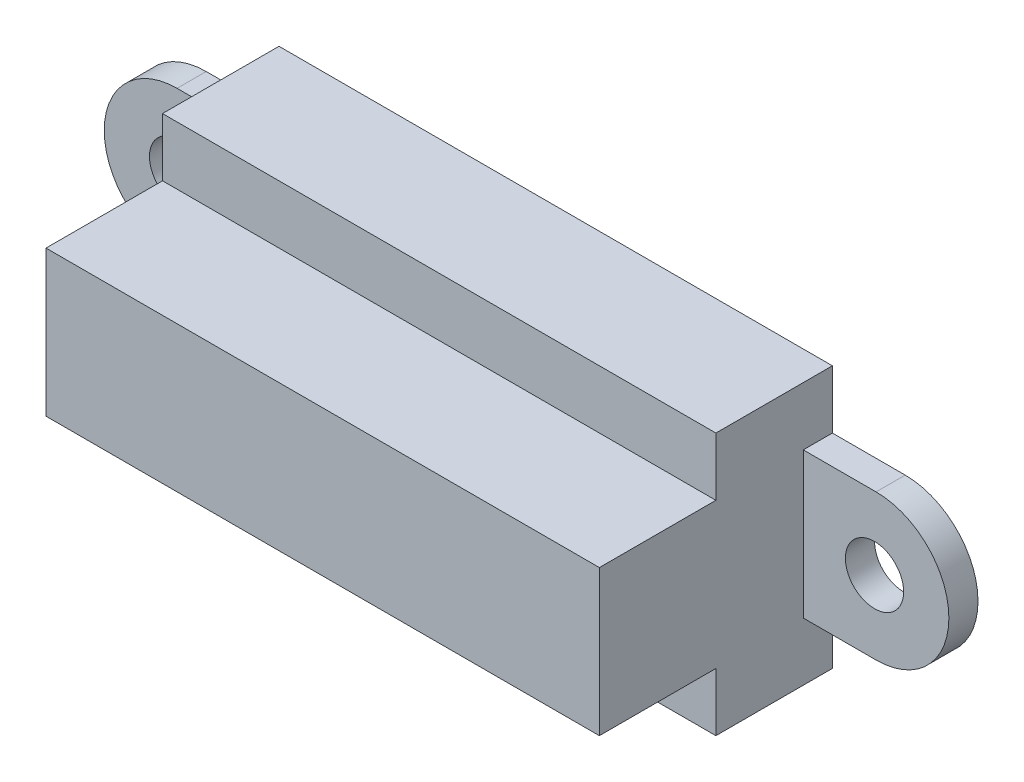
ISO-10303-21;
HEADER;
FILE_DESCRIPTION(('STEP AP214'),'2;1');
FILE_NAME('part.step','',(''),(''),'','','');
FILE_SCHEMA(('AUTOMOTIVE_DESIGN { 1 0 10303 214 1 1 1 1 }'));
ENDSEC;
DATA;
#1=APPLICATION_CONTEXT('core data for automotive mechanical design processes');
#2=APPLICATION_PROTOCOL_DEFINITION('international standard','automotive_design',2000,#1);
#3=PRODUCT_CONTEXT('',#1,'mechanical');
#4=PRODUCT('Part','Part','',(#3));
#5=PRODUCT_RELATED_PRODUCT_CATEGORY('part','',(#4));
#6=PRODUCT_DEFINITION_FORMATION('','',#4);
#7=PRODUCT_DEFINITION_CONTEXT('part definition',#1,'design');
#8=PRODUCT_DEFINITION('design','',#6,#7);
#9=PRODUCT_DEFINITION_SHAPE('','',#8);
#10=(LENGTH_UNIT() NAMED_UNIT(*) SI_UNIT(.MILLI.,.METRE.));
#11=(NAMED_UNIT(*) PLANE_ANGLE_UNIT() SI_UNIT($,.RADIAN.));
#12=(NAMED_UNIT(*) SI_UNIT($,.STERADIAN.) SOLID_ANGLE_UNIT());
#13=UNCERTAINTY_MEASURE_WITH_UNIT(LENGTH_MEASURE(1.E-05),#10,'distance_accuracy_value','');
#14=(GEOMETRIC_REPRESENTATION_CONTEXT(3) GLOBAL_UNCERTAINTY_ASSIGNED_CONTEXT((#13)) GLOBAL_UNIT_ASSIGNED_CONTEXT((#10,
#11,#12)) REPRESENTATION_CONTEXT('',''));
#15=CARTESIAN_POINT('',(0.,0.,0.));
#16=DIRECTION('',(0.,0.,1.));
#17=DIRECTION('',(1.,0.,0.));
#18=AXIS2_PLACEMENT_3D('',#15,#16,#17);
#19=CARTESIAN_POINT('',(15.08125,7.14375,0.));
#20=DIRECTION('',(0.,0.,-1.));
#21=DIRECTION('',(-1.,0.,0.));
#22=AXIS2_PLACEMENT_3D('',#19,#20,#21);
#23=PLANE('',#22);
#24=DIRECTION('',(0.,1.,0.));
#25=VECTOR('',#24,1.);
#26=CARTESIAN_POINT('',(15.08125,-7.14375,0.));
#27=LINE('',#26,#25);
#28=CARTESIAN_POINT('',(15.08125,-7.14375,0.));
#29=VERTEX_POINT('',#28);
#30=CARTESIAN_POINT('',(15.08125,-3.96875,0.));
#31=VERTEX_POINT('',#30);
#32=EDGE_CURVE('E347',#29,#31,#27,.T.);
#33=ORIENTED_EDGE('',*,*,#32,.F.);
#34=DIRECTION('',(1.,0.,0.));
#35=VECTOR('',#34,1.);
#36=CARTESIAN_POINT('',(-15.08125,-7.14375,0.));
#37=LINE('',#36,#35);
#38=CARTESIAN_POINT('',(-15.08125,-7.14375,0.));
#39=VERTEX_POINT('',#38);
#40=EDGE_CURVE('E210',#39,#29,#37,.T.);
#41=ORIENTED_EDGE('',*,*,#40,.F.);
#42=DIRECTION('',(0.,-1.,0.));
#43=VECTOR('',#42,1.);
#44=CARTESIAN_POINT('',(-15.08125,-7.14375,0.));
#45=LINE('',#44,#43);
#46=CARTESIAN_POINT('',(-15.08125,-3.96875,0.));
#47=VERTEX_POINT('',#46);
#48=EDGE_CURVE('E200',#47,#39,#45,.T.);
#49=ORIENTED_EDGE('',*,*,#48,.F.);
#50=DIRECTION('',(-1.,0.,0.));
#51=VECTOR('',#50,1.);
#52=CARTESIAN_POINT('',(27.8226999033216,-3.96875000000001,0.));
#53=LINE('',#52,#51);
#54=CARTESIAN_POINT('',(-19.05,-3.96875,0.));
#55=VERTEX_POINT('',#54);
#56=EDGE_CURVE('E50',#47,#55,#53,.T.);
#57=ORIENTED_EDGE('',*,*,#56,.T.);
#58=CARTESIAN_POINT('',(-19.05,0.,0.));
#59=DIRECTION('',(0.,0.,1.));
#60=DIRECTION('',(1.,0.,0.));
#61=AXIS2_PLACEMENT_3D('',#58,#59,#60);
#62=CIRCLE('',#61,3.96875);
#63=CARTESIAN_POINT('',(-19.05,3.96875,0.));
#64=VERTEX_POINT('',#63);
#65=EDGE_CURVE('E180',#64,#55,#62,.T.);
#66=ORIENTED_EDGE('',*,*,#65,.F.);
#67=DIRECTION('',(1.,0.,0.));
#68=VECTOR('',#67,1.);
#69=CARTESIAN_POINT('',(27.8226999033216,3.96874999999989,0.));
#70=LINE('',#69,#68);
#71=CARTESIAN_POINT('',(-15.08125,3.96875,0.));
#72=VERTEX_POINT('',#71);
#73=EDGE_CURVE('E156',#64,#72,#70,.T.);
#74=ORIENTED_EDGE('',*,*,#73,.T.);
#75=CARTESIAN_POINT('',(-15.08125,7.14375,0.));
#76=VERTEX_POINT('',#75);
#77=EDGE_CURVE('E203',#76,#72,#45,.T.);
#78=ORIENTED_EDGE('',*,*,#77,.F.);
#79=DIRECTION('',(-1.,0.,0.));
#80=VECTOR('',#79,1.);
#81=CARTESIAN_POINT('',(-15.08125,7.14375,0.));
#82=LINE('',#81,#80);
#83=CARTESIAN_POINT('',(15.08125,7.14375,0.));
#84=VERTEX_POINT('',#83);
#85=EDGE_CURVE('E204',#84,#76,#82,.T.);
#86=ORIENTED_EDGE('',*,*,#85,.F.);
#87=CARTESIAN_POINT('',(15.08125,3.96874999999999,0.));
#88=VERTEX_POINT('',#87);
#89=EDGE_CURVE('E300',#88,#84,#27,.T.);
#90=ORIENTED_EDGE('',*,*,#89,.F.);
#91=DIRECTION('',(-1.,0.,0.));
#92=VECTOR('',#91,1.);
#93=CARTESIAN_POINT('',(-27.8226999033216,3.96874999999989,0.));
#94=LINE('',#93,#92);
#95=CARTESIAN_POINT('',(19.05,3.96875,0.));
#96=VERTEX_POINT('',#95);
#97=EDGE_CURVE('E58',#96,#88,#94,.T.);
#98=ORIENTED_EDGE('',*,*,#97,.F.);
#99=CARTESIAN_POINT('',(19.05,0.,0.));
#100=DIRECTION('',(0.,0.,-1.));
#101=DIRECTION('',(-1.,0.,0.));
#102=AXIS2_PLACEMENT_3D('',#99,#100,#101);
#103=CIRCLE('',#102,3.96875);
#104=CARTESIAN_POINT('',(19.05,-3.96875,0.));
#105=VERTEX_POINT('',#104);
#106=EDGE_CURVE('E311',#96,#105,#103,.T.);
#107=ORIENTED_EDGE('',*,*,#106,.T.);
#108=DIRECTION('',(1.,0.,0.));
#109=VECTOR('',#108,1.);
#110=CARTESIAN_POINT('',(-27.8226999033216,-3.96875000000001,0.));
#111=LINE('',#110,#109);
#112=EDGE_CURVE('E304',#31,#105,#111,.T.);
#113=ORIENTED_EDGE('',*,*,#112,.F.);
#114=EDGE_LOOP('',(#33,#41,#49,#57,#66,#74,#78,#86,#90,#98,#107,#113));
#115=FACE_BOUND('',#114,.T.);
#116=CARTESIAN_POINT('',(18.96610193771,0.,0.));
#117=DIRECTION('',(0.,0.,1.));
#118=DIRECTION('',(1.,0.,0.));
#119=AXIS2_PLACEMENT_3D('',#116,#117,#118);
#120=CIRCLE('',#119,1.5875);
#121=CARTESIAN_POINT('',(20.55360193771,0.,0.));
#122=VERTEX_POINT('',#121);
#123=EDGE_CURVE('E317',#122,#122,#120,.T.);
#124=ORIENTED_EDGE('',*,*,#123,.T.);
#125=EDGE_LOOP('',(#124));
#126=FACE_BOUND('',#125,.T.);
#127=CARTESIAN_POINT('',(-18.96610193771,0.,0.));
#128=DIRECTION('',(0.,0.,-1.));
#129=DIRECTION('',(-1.,0.,0.));
#130=AXIS2_PLACEMENT_3D('',#127,#128,#129);
#131=CIRCLE('',#130,1.5875);
#132=CARTESIAN_POINT('',(-20.55360193771,0.,0.));
#133=VERTEX_POINT('',#132);
#134=EDGE_CURVE('E182',#133,#133,#131,.T.);
#135=ORIENTED_EDGE('',*,*,#134,.F.);
#136=EDGE_LOOP('',(#135));
#137=FACE_BOUND('',#136,.T.);
#138=ADVANCED_FACE('F33',(#115,#126,#137),#23,.T.);
#139=CARTESIAN_POINT('',(27.8226999033216,0.,1.5875));
#140=DIRECTION('',(0.,0.,-1.));
#141=DIRECTION('',(1.,0.,0.));
#142=AXIS2_PLACEMENT_3D('',#139,#140,#141);
#143=PLANE('',#142);
#144=CARTESIAN_POINT('',(-19.05,0.,1.5875));
#145=DIRECTION('',(0.,0.,1.));
#146=DIRECTION('',(1.,0.,0.));
#147=AXIS2_PLACEMENT_3D('',#144,#145,#146);
#148=CIRCLE('',#147,3.96875);
#149=CARTESIAN_POINT('',(-19.05,3.96875,1.5875));
#150=VERTEX_POINT('',#149);
#151=CARTESIAN_POINT('',(-19.05,-3.96875,1.5875));
#152=VERTEX_POINT('',#151);
#153=EDGE_CURVE('E164',#150,#152,#148,.T.);
#154=ORIENTED_EDGE('',*,*,#153,.T.);
#155=DIRECTION('',(-1.,0.,0.));
#156=VECTOR('',#155,1.);
#157=CARTESIAN_POINT('',(27.8226999033216,-3.96875000000001,1.5875));
#158=LINE('',#157,#156);
#159=CARTESIAN_POINT('',(-15.08125,-3.96875,1.5875));
#160=VERTEX_POINT('',#159);
#161=EDGE_CURVE('E161',#160,#152,#158,.T.);
#162=ORIENTED_EDGE('',*,*,#161,.F.);
#163=DIRECTION('',(0.,-1.,0.));
#164=VECTOR('',#163,1.);
#165=CARTESIAN_POINT('',(-15.08125,0.,1.5875));
#166=LINE('',#165,#164);
#167=CARTESIAN_POINT('',(-15.08125,3.96875,1.5875));
#168=VERTEX_POINT('',#167);
#169=EDGE_CURVE('E174',#168,#160,#166,.T.);
#170=ORIENTED_EDGE('',*,*,#169,.F.);
#171=DIRECTION('',(1.,0.,0.));
#172=VECTOR('',#171,1.);
#173=CARTESIAN_POINT('',(27.8226999033216,3.96874999999989,1.5875));
#174=LINE('',#173,#172);
#175=EDGE_CURVE('E153',#150,#168,#174,.T.);
#176=ORIENTED_EDGE('',*,*,#175,.F.);
#177=EDGE_LOOP('',(#154,#162,#170,#176));
#178=FACE_BOUND('',#177,.T.);
#179=CARTESIAN_POINT('',(-18.96610193771,0.,1.5875));
#180=DIRECTION('',(0.,0.,-1.));
#181=DIRECTION('',(-1.,0.,0.));
#182=AXIS2_PLACEMENT_3D('',#179,#180,#181);
#183=CIRCLE('',#182,1.5875);
#184=CARTESIAN_POINT('',(-20.55360193771,0.,1.5875));
#185=VERTEX_POINT('',#184);
#186=EDGE_CURVE('E555',#185,#185,#183,.T.);
#187=ORIENTED_EDGE('',*,*,#186,.T.);
#188=EDGE_LOOP('',(#187));
#189=FACE_BOUND('',#188,.T.);
#190=ADVANCED_FACE('F171',(#178,#189),#143,.F.);
#191=CARTESIAN_POINT('',(-15.08125,-7.14375,6.35));
#192=DIRECTION('',(1.,0.,0.));
#193=DIRECTION('',(0.,0.,-1.));
#194=AXIS2_PLACEMENT_3D('',#191,#192,#193);
#195=PLANE('',#194);
#196=DIRECTION('',(0.,0.,-1.));
#197=VECTOR('',#196,1.);
#198=CARTESIAN_POINT('',(-15.08125,3.96875,1.5875));
#199=LINE('',#198,#197);
#200=EDGE_CURVE('E160',#168,#72,#199,.T.);
#201=ORIENTED_EDGE('',*,*,#200,.F.);
#202=ORIENTED_EDGE('',*,*,#169,.T.);
#203=DIRECTION('',(0.,0.,-1.));
#204=VECTOR('',#203,1.);
#205=CARTESIAN_POINT('',(-15.08125,-3.96875,1.5875));
#206=LINE('',#205,#204);
#207=EDGE_CURVE('E185',#160,#47,#206,.T.);
#208=ORIENTED_EDGE('',*,*,#207,.T.);
#209=ORIENTED_EDGE('',*,*,#48,.T.);
#210=DIRECTION('',(0.,0.,-1.));
#211=VECTOR('',#210,1.);
#212=CARTESIAN_POINT('',(-15.08125,-7.14375,6.35));
#213=LINE('',#212,#211);
#214=CARTESIAN_POINT('',(-15.08125,-7.14375,6.35));
#215=VERTEX_POINT('',#214);
#216=EDGE_CURVE('E217',#215,#39,#213,.T.);
#217=ORIENTED_EDGE('',*,*,#216,.F.);
#218=DIRECTION('',(0.,-1.,0.));
#219=VECTOR('',#218,1.);
#220=CARTESIAN_POINT('',(-15.08125,-7.14375,6.35));
#221=LINE('',#220,#219);
#222=CARTESIAN_POINT('',(-15.08125,-3.96875,6.35));
#223=VERTEX_POINT('',#222);
#224=EDGE_CURVE('E235',#223,#215,#221,.T.);
#225=ORIENTED_EDGE('',*,*,#224,.F.);
#226=DIRECTION('',(0.,0.,-1.));
#227=VECTOR('',#226,1.);
#228=CARTESIAN_POINT('',(-15.08125,-3.96875,12.7));
#229=LINE('',#228,#227);
#230=CARTESIAN_POINT('',(-15.08125,-3.96875,12.7));
#231=VERTEX_POINT('',#230);
#232=EDGE_CURVE('E271',#231,#223,#229,.T.);
#233=ORIENTED_EDGE('',*,*,#232,.F.);
#234=DIRECTION('',(0.,-1.,0.));
#235=VECTOR('',#234,1.);
#236=CARTESIAN_POINT('',(-15.08125,3.96875,12.7));
#237=LINE('',#236,#235);
#238=CARTESIAN_POINT('',(-15.08125,3.96875,12.7));
#239=VERTEX_POINT('',#238);
#240=EDGE_CURVE('E274',#239,#231,#237,.T.);
#241=ORIENTED_EDGE('',*,*,#240,.F.);
#242=DIRECTION('',(0.,0.,-1.));
#243=VECTOR('',#242,1.);
#244=CARTESIAN_POINT('',(-15.08125,3.96875,12.7));
#245=LINE('',#244,#243);
#246=CARTESIAN_POINT('',(-15.08125,3.96874999999999,6.35));
#247=VERTEX_POINT('',#246);
#248=EDGE_CURVE('E284',#239,#247,#245,.T.);
#249=ORIENTED_EDGE('',*,*,#248,.T.);
#250=CARTESIAN_POINT('',(-15.08125,7.14375,6.35));
#251=VERTEX_POINT('',#250);
#252=EDGE_CURVE('E241',#251,#247,#221,.T.);
#253=ORIENTED_EDGE('',*,*,#252,.F.);
#254=DIRECTION('',(0.,0.,-1.));
#255=VECTOR('',#254,1.);
#256=CARTESIAN_POINT('',(-15.08125,7.14375,6.35));
#257=LINE('',#256,#255);
#258=EDGE_CURVE('E42',#251,#76,#257,.T.);
#259=ORIENTED_EDGE('',*,*,#258,.T.);
#260=ORIENTED_EDGE('',*,*,#77,.T.);
#261=EDGE_LOOP('',(#201,#202,#208,#209,#217,#225,#233,#241,#249,#253,#259,#260));
#262=FACE_BOUND('',#261,.T.);
#263=ADVANCED_FACE('F256',(#262),#195,.F.);
#264=CARTESIAN_POINT('',(15.08125,-7.14375,6.35));
#265=DIRECTION('',(-1.,0.,0.));
#266=DIRECTION('',(0.,0.,1.));
#267=AXIS2_PLACEMENT_3D('',#264,#265,#266);
#268=PLANE('',#267);
#269=DIRECTION('',(0.,0.,-1.));
#270=VECTOR('',#269,1.);
#271=CARTESIAN_POINT('',(15.08125,-3.96875,1.5875));
#272=LINE('',#271,#270);
#273=CARTESIAN_POINT('',(15.08125,-3.96875,1.5875));
#274=VERTEX_POINT('',#273);
#275=EDGE_CURVE('E293',#274,#31,#272,.T.);
#276=ORIENTED_EDGE('',*,*,#275,.F.);
#277=DIRECTION('',(0.,-1.,0.));
#278=VECTOR('',#277,1.);
#279=CARTESIAN_POINT('',(15.08125,0.,1.5875));
#280=LINE('',#279,#278);
#281=CARTESIAN_POINT('',(15.08125,3.96875,1.5875));
#282=VERTEX_POINT('',#281);
#283=EDGE_CURVE('E322',#282,#274,#280,.T.);
#284=ORIENTED_EDGE('',*,*,#283,.F.);
#285=DIRECTION('',(0.,0.,-1.));
#286=VECTOR('',#285,1.);
#287=CARTESIAN_POINT('',(15.08125,3.96875,1.5875));
#288=LINE('',#287,#286);
#289=EDGE_CURVE('E276',#282,#88,#288,.T.);
#290=ORIENTED_EDGE('',*,*,#289,.T.);
#291=ORIENTED_EDGE('',*,*,#89,.T.);
#292=DIRECTION('',(0.,0.,-1.));
#293=VECTOR('',#292,1.);
#294=CARTESIAN_POINT('',(15.08125,7.14375,6.35));
#295=LINE('',#294,#293);
#296=CARTESIAN_POINT('',(15.08125,7.14375,6.35));
#297=VERTEX_POINT('',#296);
#298=EDGE_CURVE('E11',#297,#84,#295,.T.);
#299=ORIENTED_EDGE('',*,*,#298,.F.);
#300=DIRECTION('',(0.,1.,0.));
#301=VECTOR('',#300,1.);
#302=CARTESIAN_POINT('',(15.08125,-7.14375,6.35));
#303=LINE('',#302,#301);
#304=CARTESIAN_POINT('',(15.08125,3.96874999999999,6.35));
#305=VERTEX_POINT('',#304);
#306=EDGE_CURVE('E213',#305,#297,#303,.T.);
#307=ORIENTED_EDGE('',*,*,#306,.F.);
#308=DIRECTION('',(0.,0.,-1.));
#309=VECTOR('',#308,1.);
#310=CARTESIAN_POINT('',(15.08125,3.96875,12.7));
#311=LINE('',#310,#309);
#312=CARTESIAN_POINT('',(15.08125,3.96875,12.7));
#313=VERTEX_POINT('',#312);
#314=EDGE_CURVE('E353',#313,#305,#311,.T.);
#315=ORIENTED_EDGE('',*,*,#314,.F.);
#316=DIRECTION('',(0.,1.,0.));
#317=VECTOR('',#316,1.);
#318=CARTESIAN_POINT('',(15.08125,3.96875,12.7));
#319=LINE('',#318,#317);
#320=CARTESIAN_POINT('',(15.08125,-3.96875,12.7));
#321=VERTEX_POINT('',#320);
#322=EDGE_CURVE('E285',#321,#313,#319,.T.);
#323=ORIENTED_EDGE('',*,*,#322,.F.);
#324=DIRECTION('',(0.,0.,-1.));
#325=VECTOR('',#324,1.);
#326=CARTESIAN_POINT('',(15.08125,-3.96875,12.7));
#327=LINE('',#326,#325);
#328=CARTESIAN_POINT('',(15.08125,-3.96875,6.35));
#329=VERTEX_POINT('',#328);
#330=EDGE_CURVE('E268',#321,#329,#327,.T.);
#331=ORIENTED_EDGE('',*,*,#330,.T.);
#332=CARTESIAN_POINT('',(15.08125,-7.14375,6.35));
#333=VERTEX_POINT('',#332);
#334=EDGE_CURVE('E223',#333,#329,#303,.T.);
#335=ORIENTED_EDGE('',*,*,#334,.F.);
#336=DIRECTION('',(0.,0.,-1.));
#337=VECTOR('',#336,1.);
#338=CARTESIAN_POINT('',(15.08125,-7.14375,6.35));
#339=LINE('',#338,#337);
#340=EDGE_CURVE('E214',#333,#29,#339,.T.);
#341=ORIENTED_EDGE('',*,*,#340,.T.);
#342=ORIENTED_EDGE('',*,*,#32,.T.);
#343=EDGE_LOOP('',(#276,#284,#290,#291,#299,#307,#315,#323,#331,#335,#341,#342));
#344=FACE_BOUND('',#343,.T.);
#345=ADVANCED_FACE('F35',(#344),#268,.F.);
#346=CARTESIAN_POINT('',(15.08125,7.14375,6.35));
#347=DIRECTION('',(0.,0.,-1.));
#348=DIRECTION('',(-1.,0.,0.));
#349=AXIS2_PLACEMENT_3D('',#346,#347,#348);
#350=PLANE('',#349);
#351=DIRECTION('',(-1.,0.,0.));
#352=VECTOR('',#351,1.);
#353=CARTESIAN_POINT('',(-15.08125,3.96875,6.35));
#354=LINE('',#353,#352);
#355=EDGE_CURVE('E272',#305,#247,#354,.T.);
#356=ORIENTED_EDGE('',*,*,#355,.F.);
#357=ORIENTED_EDGE('',*,*,#306,.T.);
#358=DIRECTION('',(-1.,0.,0.));
#359=VECTOR('',#358,1.);
#360=CARTESIAN_POINT('',(-15.08125,7.14375,6.35));
#361=LINE('',#360,#359);
#362=EDGE_CURVE('E226',#297,#251,#361,.T.);
#363=ORIENTED_EDGE('',*,*,#362,.T.);
#364=ORIENTED_EDGE('',*,*,#252,.T.);
#365=EDGE_LOOP('',(#356,#357,#363,#364));
#366=FACE_BOUND('',#365,.T.);
#367=ADVANCED_FACE('F370',(#366),#350,.F.);
#368=DIRECTION('',(1.,0.,0.));
#369=VECTOR('',#368,1.);
#370=CARTESIAN_POINT('',(-15.08125,-3.96875,6.35));
#371=LINE('',#370,#369);
#372=EDGE_CURVE('E252',#223,#329,#371,.T.);
#373=ORIENTED_EDGE('',*,*,#372,.F.);
#374=ORIENTED_EDGE('',*,*,#224,.T.);
#375=DIRECTION('',(1.,0.,0.));
#376=VECTOR('',#375,1.);
#377=CARTESIAN_POINT('',(-15.08125,-7.14375,6.35));
#378=LINE('',#377,#376);
#379=EDGE_CURVE('E218',#215,#333,#378,.T.);
#380=ORIENTED_EDGE('',*,*,#379,.T.);
#381=ORIENTED_EDGE('',*,*,#334,.T.);
#382=EDGE_LOOP('',(#373,#374,#380,#381));
#383=FACE_BOUND('',#382,.T.);
#384=ADVANCED_FACE('F248',(#383),#350,.F.);
#385=CARTESIAN_POINT('',(-15.08125,7.14375,6.35));
#386=DIRECTION('',(0.,-1.,0.));
#387=DIRECTION('',(0.,0.,-1.));
#388=AXIS2_PLACEMENT_3D('',#385,#386,#387);
#389=PLANE('',#388);
#390=ORIENTED_EDGE('',*,*,#85,.T.);
#391=ORIENTED_EDGE('',*,*,#258,.F.);
#392=ORIENTED_EDGE('',*,*,#362,.F.);
#393=ORIENTED_EDGE('',*,*,#298,.T.);
#394=EDGE_LOOP('',(#390,#391,#392,#393));
#395=FACE_BOUND('',#394,.T.);
#396=ADVANCED_FACE('F375',(#395),#389,.F.);
#397=CARTESIAN_POINT('',(-15.08125,-7.14375,6.35));
#398=DIRECTION('',(0.,1.,0.));
#399=DIRECTION('',(0.,0.,1.));
#400=AXIS2_PLACEMENT_3D('',#397,#398,#399);
#401=PLANE('',#400);
#402=ORIENTED_EDGE('',*,*,#40,.T.);
#403=ORIENTED_EDGE('',*,*,#340,.F.);
#404=ORIENTED_EDGE('',*,*,#379,.F.);
#405=ORIENTED_EDGE('',*,*,#216,.T.);
#406=EDGE_LOOP('',(#402,#403,#404,#405));
#407=FACE_BOUND('',#406,.T.);
#408=ADVANCED_FACE('F259',(#407),#401,.F.);
#409=CARTESIAN_POINT('',(-15.08125,-3.96875,12.7));
#410=DIRECTION('',(0.,1.,0.));
#411=DIRECTION('',(0.,0.,1.));
#412=AXIS2_PLACEMENT_3D('',#409,#410,#411);
#413=PLANE('',#412);
#414=ORIENTED_EDGE('',*,*,#372,.T.);
#415=ORIENTED_EDGE('',*,*,#330,.F.);
#416=DIRECTION('',(1.,0.,0.));
#417=VECTOR('',#416,1.);
#418=CARTESIAN_POINT('',(-15.08125,-3.96875,12.7));
#419=LINE('',#418,#417);
#420=EDGE_CURVE('E287',#231,#321,#419,.T.);
#421=ORIENTED_EDGE('',*,*,#420,.F.);
#422=ORIENTED_EDGE('',*,*,#232,.T.);
#423=EDGE_LOOP('',(#414,#415,#421,#422));
#424=FACE_BOUND('',#423,.T.);
#425=ADVANCED_FACE('F270',(#424),#413,.F.);
#426=CARTESIAN_POINT('',(-15.08125,3.96875,12.7));
#427=DIRECTION('',(0.,-1.,0.));
#428=DIRECTION('',(0.,0.,-1.));
#429=AXIS2_PLACEMENT_3D('',#426,#427,#428);
#430=PLANE('',#429);
#431=ORIENTED_EDGE('',*,*,#355,.T.);
#432=ORIENTED_EDGE('',*,*,#248,.F.);
#433=DIRECTION('',(-1.,0.,0.));
#434=VECTOR('',#433,1.);
#435=CARTESIAN_POINT('',(-15.08125,3.96875,12.7));
#436=LINE('',#435,#434);
#437=EDGE_CURVE('E282',#313,#239,#436,.T.);
#438=ORIENTED_EDGE('',*,*,#437,.F.);
#439=ORIENTED_EDGE('',*,*,#314,.T.);
#440=EDGE_LOOP('',(#431,#432,#438,#439));
#441=FACE_BOUND('',#440,.T.);
#442=ADVANCED_FACE('F367',(#441),#430,.F.);
#443=CARTESIAN_POINT('',(-15.08125,-3.96875,12.7));
#444=DIRECTION('',(0.,0.,1.));
#445=DIRECTION('',(1.,0.,0.));
#446=AXIS2_PLACEMENT_3D('',#443,#444,#445);
#447=PLANE('',#446);
#448=ORIENTED_EDGE('',*,*,#240,.T.);
#449=ORIENTED_EDGE('',*,*,#420,.T.);
#450=ORIENTED_EDGE('',*,*,#322,.T.);
#451=ORIENTED_EDGE('',*,*,#437,.T.);
#452=EDGE_LOOP('',(#448,#449,#450,#451));
#453=FACE_BOUND('',#452,.T.);
#454=ADVANCED_FACE('F471',(#453),#447,.T.);
#455=CARTESIAN_POINT('',(19.05,0.,1.5875));
#456=DIRECTION('',(0.,0.,-1.));
#457=DIRECTION('',(-1.,0.,0.));
#458=AXIS2_PLACEMENT_3D('',#455,#456,#457);
#459=CYLINDRICAL_SURFACE('',#458,3.96875);
#460=ORIENTED_EDGE('',*,*,#106,.F.);
#461=DIRECTION('',(0.,0.,-1.));
#462=VECTOR('',#461,1.);
#463=CARTESIAN_POINT('',(19.05,3.96875,1.5875));
#464=LINE('',#463,#462);
#465=CARTESIAN_POINT('',(19.05,3.96875,1.5875));
#466=VERTEX_POINT('',#465);
#467=EDGE_CURVE('E273',#466,#96,#464,.T.);
#468=ORIENTED_EDGE('',*,*,#467,.F.);
#469=CARTESIAN_POINT('',(19.05,0.,1.5875));
#470=DIRECTION('',(0.,0.,-1.));
#471=DIRECTION('',(-1.,0.,0.));
#472=AXIS2_PLACEMENT_3D('',#469,#470,#471);
#473=CIRCLE('',#472,3.96875);
#474=CARTESIAN_POINT('',(19.05,-3.96875,1.5875));
#475=VERTEX_POINT('',#474);
#476=EDGE_CURVE('E303',#466,#475,#473,.T.);
#477=ORIENTED_EDGE('',*,*,#476,.T.);
#478=DIRECTION('',(0.,0.,-1.));
#479=VECTOR('',#478,1.);
#480=CARTESIAN_POINT('',(19.05,-3.96875,1.5875));
#481=LINE('',#480,#479);
#482=EDGE_CURVE('E291',#475,#105,#481,.T.);
#483=ORIENTED_EDGE('',*,*,#482,.T.);
#484=EDGE_LOOP('',(#460,#468,#477,#483));
#485=FACE_BOUND('',#484,.T.);
#486=ADVANCED_FACE('F342',(#485),#459,.T.);
#487=CARTESIAN_POINT('',(-27.8226999033216,3.96874999999989,1.5875));
#488=DIRECTION('',(0.,-1.,0.));
#489=DIRECTION('',(1.,0.,0.));
#490=AXIS2_PLACEMENT_3D('',#487,#488,#489);
#491=PLANE('',#490);
#492=ORIENTED_EDGE('',*,*,#97,.T.);
#493=ORIENTED_EDGE('',*,*,#289,.F.);
#494=DIRECTION('',(-1.,0.,0.));
#495=VECTOR('',#494,1.);
#496=CARTESIAN_POINT('',(-27.8226999033216,3.96874999999989,1.5875));
#497=LINE('',#496,#495);
#498=EDGE_CURVE('E294',#466,#282,#497,.T.);
#499=ORIENTED_EDGE('',*,*,#498,.F.);
#500=ORIENTED_EDGE('',*,*,#467,.T.);
#501=EDGE_LOOP('',(#492,#493,#499,#500));
#502=FACE_BOUND('',#501,.T.);
#503=ADVANCED_FACE('F343',(#502),#491,.F.);
#504=CARTESIAN_POINT('',(-27.8226999033216,-3.96875000000001,1.5875));
#505=DIRECTION('',(0.,1.,0.));
#506=DIRECTION('',(-1.,0.,0.));
#507=AXIS2_PLACEMENT_3D('',#504,#505,#506);
#508=PLANE('',#507);
#509=ORIENTED_EDGE('',*,*,#112,.T.);
#510=ORIENTED_EDGE('',*,*,#482,.F.);
#511=DIRECTION('',(1.,0.,0.));
#512=VECTOR('',#511,1.);
#513=CARTESIAN_POINT('',(-27.8226999033216,-3.96875000000001,1.5875));
#514=LINE('',#513,#512);
#515=EDGE_CURVE('E324',#274,#475,#514,.T.);
#516=ORIENTED_EDGE('',*,*,#515,.F.);
#517=ORIENTED_EDGE('',*,*,#275,.T.);
#518=EDGE_LOOP('',(#509,#510,#516,#517));
#519=FACE_BOUND('',#518,.T.);
#520=ADVANCED_FACE('F336',(#519),#508,.F.);
#521=CARTESIAN_POINT('',(-27.8226999033216,0.,1.5875));
#522=DIRECTION('',(0.,0.,-1.));
#523=DIRECTION('',(-1.,0.,0.));
#524=AXIS2_PLACEMENT_3D('',#521,#522,#523);
#525=PLANE('',#524);
#526=CARTESIAN_POINT('',(18.96610193771,0.,1.5875));
#527=DIRECTION('',(0.,0.,1.));
#528=DIRECTION('',(1.,0.,0.));
#529=AXIS2_PLACEMENT_3D('',#526,#527,#528);
#530=CIRCLE('',#529,1.5875);
#531=CARTESIAN_POINT('',(20.55360193771,0.,1.5875));
#532=VERTEX_POINT('',#531);
#533=EDGE_CURVE('E184',#532,#532,#530,.T.);
#534=ORIENTED_EDGE('',*,*,#533,.F.);
#535=EDGE_LOOP('',(#534));
#536=FACE_BOUND('',#535,.T.);
#537=ORIENTED_EDGE('',*,*,#476,.F.);
#538=ORIENTED_EDGE('',*,*,#498,.T.);
#539=ORIENTED_EDGE('',*,*,#283,.T.);
#540=ORIENTED_EDGE('',*,*,#515,.T.);
#541=EDGE_LOOP('',(#537,#538,#539,#540));
#542=FACE_BOUND('',#541,.T.);
#543=ADVANCED_FACE('F333',(#536,#542),#525,.F.);
#544=CARTESIAN_POINT('',(18.96610193771,0.,0.));
#545=DIRECTION('',(0.,0.,1.));
#546=DIRECTION('',(1.,0.,0.));
#547=AXIS2_PLACEMENT_3D('',#544,#545,#546);
#548=CYLINDRICAL_SURFACE('',#547,1.5875);
#549=ORIENTED_EDGE('',*,*,#123,.F.);
#550=EDGE_LOOP('',(#549));
#551=FACE_BOUND('',#550,.T.);
#552=ORIENTED_EDGE('',*,*,#533,.T.);
#553=EDGE_LOOP('',(#552));
#554=FACE_BOUND('',#553,.T.);
#555=ADVANCED_FACE('F331',(#551,#554),#548,.F.);
#556=CARTESIAN_POINT('',(-19.05,0.,1.5875));
#557=DIRECTION('',(0.,0.,-1.));
#558=DIRECTION('',(-1.,0.,0.));
#559=AXIS2_PLACEMENT_3D('',#556,#557,#558);
#560=CYLINDRICAL_SURFACE('',#559,3.96875);
#561=ORIENTED_EDGE('',*,*,#65,.T.);
#562=DIRECTION('',(0.,0.,-1.));
#563=VECTOR('',#562,1.);
#564=CARTESIAN_POINT('',(-19.05,-3.96875,1.5875));
#565=LINE('',#564,#563);
#566=EDGE_CURVE('E166',#152,#55,#565,.T.);
#567=ORIENTED_EDGE('',*,*,#566,.F.);
#568=ORIENTED_EDGE('',*,*,#153,.F.);
#569=DIRECTION('',(0.,0.,-1.));
#570=VECTOR('',#569,1.);
#571=CARTESIAN_POINT('',(-19.05,3.96875,1.5875));
#572=LINE('',#571,#570);
#573=EDGE_CURVE('E149',#150,#64,#572,.T.);
#574=ORIENTED_EDGE('',*,*,#573,.T.);
#575=EDGE_LOOP('',(#561,#567,#568,#574));
#576=FACE_BOUND('',#575,.T.);
#577=ADVANCED_FACE('F165',(#576),#560,.T.);
#578=CARTESIAN_POINT('',(27.8226999033216,-3.96875000000001,1.5875));
#579=DIRECTION('',(0.,-1.,0.));
#580=DIRECTION('',(1.,0.,0.));
#581=AXIS2_PLACEMENT_3D('',#578,#579,#580);
#582=PLANE('',#581);
#583=ORIENTED_EDGE('',*,*,#56,.F.);
#584=ORIENTED_EDGE('',*,*,#207,.F.);
#585=ORIENTED_EDGE('',*,*,#161,.T.);
#586=ORIENTED_EDGE('',*,*,#566,.T.);
#587=EDGE_LOOP('',(#583,#584,#585,#586));
#588=FACE_BOUND('',#587,.T.);
#589=ADVANCED_FACE('F377',(#588),#582,.T.);
#590=CARTESIAN_POINT('',(27.8226999033216,3.96874999999989,1.5875));
#591=DIRECTION('',(0.,1.,0.));
#592=DIRECTION('',(-1.,0.,0.));
#593=AXIS2_PLACEMENT_3D('',#590,#591,#592);
#594=PLANE('',#593);
#595=ORIENTED_EDGE('',*,*,#73,.F.);
#596=ORIENTED_EDGE('',*,*,#573,.F.);
#597=ORIENTED_EDGE('',*,*,#175,.T.);
#598=ORIENTED_EDGE('',*,*,#200,.T.);
#599=EDGE_LOOP('',(#595,#596,#597,#598));
#600=FACE_BOUND('',#599,.T.);
#601=ADVANCED_FACE('F151',(#600),#594,.T.);
#602=CARTESIAN_POINT('',(-18.96610193771,0.,0.));
#603=DIRECTION('',(0.,0.,1.));
#604=DIRECTION('',(1.,0.,0.));
#605=AXIS2_PLACEMENT_3D('',#602,#603,#604);
#606=CYLINDRICAL_SURFACE('',#605,1.5875);
#607=ORIENTED_EDGE('',*,*,#134,.T.);
#608=EDGE_LOOP('',(#607));
#609=FACE_BOUND('',#608,.T.);
#610=ORIENTED_EDGE('',*,*,#186,.F.);
#611=EDGE_LOOP('',(#610));
#612=FACE_BOUND('',#611,.T.);
#613=ADVANCED_FACE('F384',(#609,#612),#606,.F.);
#614=CLOSED_SHELL('',(#138,#190,#263,#345,#367,#384,#396,#408,#425,#442,#454,#486,#503,#520,
#543,#555,#577,#589,#601,#613));
#615=MANIFOLD_SOLID_BREP('B2',#614);
#616=ADVANCED_BREP_SHAPE_REPRESENTATION('',(#18,#615),#14);
#617=SHAPE_DEFINITION_REPRESENTATION(#9,#616);
ENDSEC;
END-ISO-10303-21;
